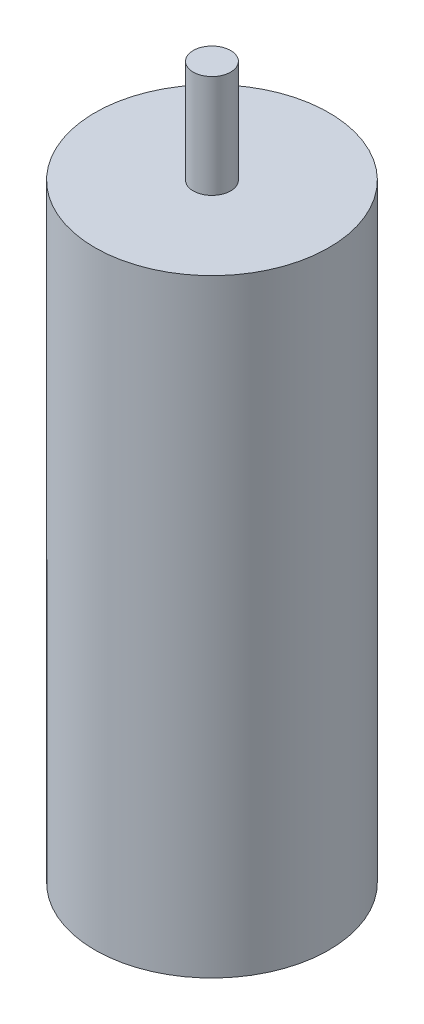
ISO-10303-21;
HEADER;
FILE_DESCRIPTION(('STEP AP214'),'2;1');
FILE_NAME('part.step','',(''),(''),'','','');
FILE_SCHEMA(('AUTOMOTIVE_DESIGN { 1 0 10303 214 1 1 1 1 }'));
ENDSEC;
DATA;
#1=APPLICATION_CONTEXT('core data for automotive mechanical design processes');
#2=APPLICATION_PROTOCOL_DEFINITION('international standard','automotive_design',2000,#1);
#3=PRODUCT_CONTEXT('',#1,'mechanical');
#4=PRODUCT('Part','Part','',(#3));
#5=PRODUCT_RELATED_PRODUCT_CATEGORY('part','',(#4));
#6=PRODUCT_DEFINITION_FORMATION('','',#4);
#7=PRODUCT_DEFINITION_CONTEXT('part definition',#1,'design');
#8=PRODUCT_DEFINITION('design','',#6,#7);
#9=PRODUCT_DEFINITION_SHAPE('','',#8);
#10=(LENGTH_UNIT() NAMED_UNIT(*) SI_UNIT(.MILLI.,.METRE.));
#11=(NAMED_UNIT(*) PLANE_ANGLE_UNIT() SI_UNIT($,.RADIAN.));
#12=(NAMED_UNIT(*) SI_UNIT($,.STERADIAN.) SOLID_ANGLE_UNIT());
#13=UNCERTAINTY_MEASURE_WITH_UNIT(LENGTH_MEASURE(1.E-05),#10,'distance_accuracy_value','');
#14=(GEOMETRIC_REPRESENTATION_CONTEXT(3) GLOBAL_UNCERTAINTY_ASSIGNED_CONTEXT((#13)) GLOBAL_UNIT_ASSIGNED_CONTEXT((#10,
#11,#12)) REPRESENTATION_CONTEXT('',''));
#15=CARTESIAN_POINT('',(0.,0.,0.));
#16=DIRECTION('',(0.,0.,1.));
#17=DIRECTION('',(1.,0.,0.));
#18=AXIS2_PLACEMENT_3D('',#15,#16,#17);
#19=CARTESIAN_POINT('',(0.,65.,0.));
#20=DIRECTION('',(0.,-1.,0.));
#21=DIRECTION('',(0.,0.,-1.));
#22=AXIS2_PLACEMENT_3D('',#19,#20,#21);
#23=CYLINDRICAL_SURFACE('',#22,12.5);
#24=CARTESIAN_POINT('',(0.,65.,0.));
#25=DIRECTION('',(0.,1.,0.));
#26=DIRECTION('',(0.,0.,1.));
#27=AXIS2_PLACEMENT_3D('',#24,#25,#26);
#28=CIRCLE('',#27,12.5);
#29=CARTESIAN_POINT('',(0.,65.,12.5));
#30=VERTEX_POINT('',#29);
#31=EDGE_CURVE('E38',#30,#30,#28,.T.);
#32=ORIENTED_EDGE('',*,*,#31,.F.);
#33=EDGE_LOOP('',(#32));
#34=FACE_BOUND('',#33,.T.);
#35=CARTESIAN_POINT('',(0.,0.,0.));
#36=DIRECTION('',(0.,1.,0.));
#37=DIRECTION('',(0.,0.,1.));
#38=AXIS2_PLACEMENT_3D('',#35,#36,#37);
#39=CIRCLE('',#38,12.5);
#40=CARTESIAN_POINT('',(0.,0.,12.5));
#41=VERTEX_POINT('',#40);
#42=EDGE_CURVE('E34',#41,#41,#39,.T.);
#43=ORIENTED_EDGE('',*,*,#42,.T.);
#44=EDGE_LOOP('',(#43));
#45=FACE_BOUND('',#44,.T.);
#46=ADVANCED_FACE('F31',(#34,#45),#23,.T.);
#47=CARTESIAN_POINT('',(0.,65.,0.));
#48=DIRECTION('',(0.,1.,0.));
#49=DIRECTION('',(0.,0.,1.));
#50=AXIS2_PLACEMENT_3D('',#47,#48,#49);
#51=PLANE('',#50);
#52=CARTESIAN_POINT('',(0.,65.,0.));
#53=DIRECTION('',(0.,1.,0.));
#54=DIRECTION('',(0.,0.,1.));
#55=AXIS2_PLACEMENT_3D('',#52,#53,#54);
#56=CIRCLE('',#55,2.);
#57=CARTESIAN_POINT('',(0.,65.,2.));
#58=VERTEX_POINT('',#57);
#59=EDGE_CURVE('E10',#58,#58,#56,.T.);
#60=ORIENTED_EDGE('',*,*,#59,.F.);
#61=EDGE_LOOP('',(#60));
#62=FACE_BOUND('',#61,.T.);
#63=ORIENTED_EDGE('',*,*,#31,.T.);
#64=EDGE_LOOP('',(#63));
#65=FACE_BOUND('',#64,.T.);
#66=ADVANCED_FACE('F55',(#62,#65),#51,.T.);
#67=CARTESIAN_POINT('',(0.,0.,0.));
#68=DIRECTION('',(0.,1.,0.));
#69=DIRECTION('',(0.,0.,1.));
#70=AXIS2_PLACEMENT_3D('',#67,#68,#69);
#71=PLANE('',#70);
#72=ORIENTED_EDGE('',*,*,#42,.F.);
#73=EDGE_LOOP('',(#72));
#74=FACE_BOUND('',#73,.T.);
#75=ADVANCED_FACE('F52',(#74),#71,.F.);
#76=CARTESIAN_POINT('',(0.,76.,0.));
#77=DIRECTION('',(0.,-1.,0.));
#78=DIRECTION('',(0.,0.,-1.));
#79=AXIS2_PLACEMENT_3D('',#76,#77,#78);
#80=CYLINDRICAL_SURFACE('',#79,2.);
#81=CARTESIAN_POINT('',(0.,76.,0.));
#82=DIRECTION('',(0.,1.,0.));
#83=DIRECTION('',(0.,0.,1.));
#84=AXIS2_PLACEMENT_3D('',#81,#82,#83);
#85=CIRCLE('',#84,2.);
#86=CARTESIAN_POINT('',(0.,76.,2.));
#87=VERTEX_POINT('',#86);
#88=EDGE_CURVE('E44',#87,#87,#85,.T.);
#89=ORIENTED_EDGE('',*,*,#88,.F.);
#90=EDGE_LOOP('',(#89));
#91=FACE_BOUND('',#90,.T.);
#92=ORIENTED_EDGE('',*,*,#59,.T.);
#93=EDGE_LOOP('',(#92));
#94=FACE_BOUND('',#93,.T.);
#95=ADVANCED_FACE('F54',(#91,#94),#80,.T.);
#96=CARTESIAN_POINT('',(0.,76.,0.));
#97=DIRECTION('',(0.,1.,0.));
#98=DIRECTION('',(0.,0.,1.));
#99=AXIS2_PLACEMENT_3D('',#96,#97,#98);
#100=PLANE('',#99);
#101=ORIENTED_EDGE('',*,*,#88,.T.);
#102=EDGE_LOOP('',(#101));
#103=FACE_BOUND('',#102,.T.);
#104=ADVANCED_FACE('F60',(#103),#100,.T.);
#105=CLOSED_SHELL('',(#46,#66,#75,#95,#104));
#106=MANIFOLD_SOLID_BREP('B2',#105);
#107=ADVANCED_BREP_SHAPE_REPRESENTATION('',(#18,#106),#14);
#108=SHAPE_DEFINITION_REPRESENTATION(#9,#107);
ENDSEC;
END-ISO-10303-21;
